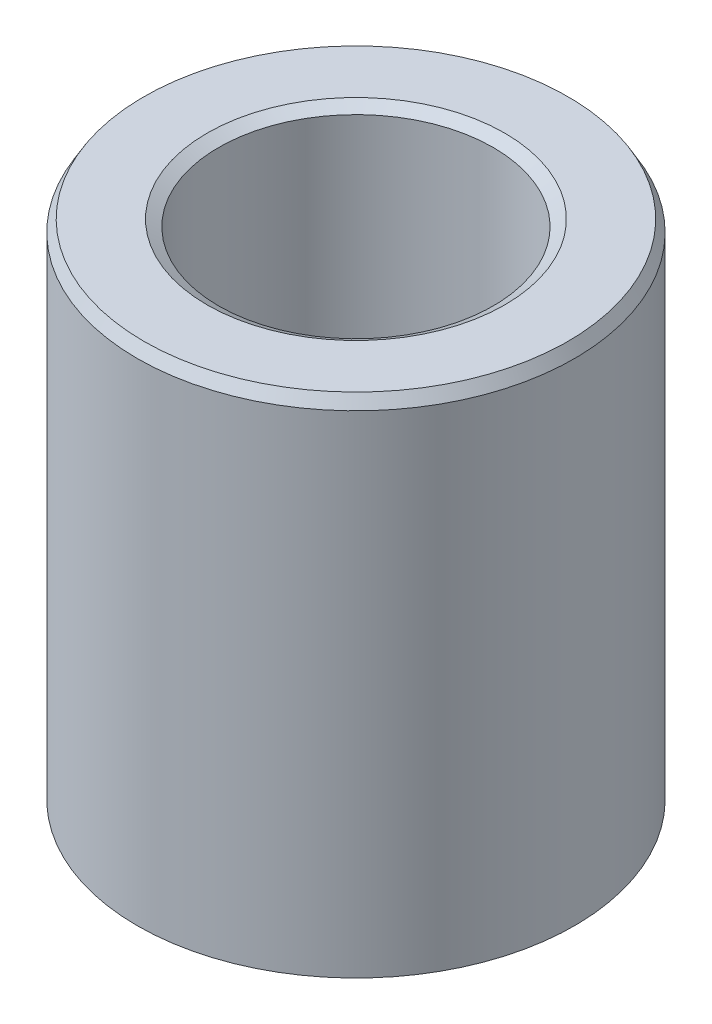
ISO-10303-21;
HEADER;
FILE_DESCRIPTION(('STEP AP214'),'2;1');
FILE_NAME('part.step','',(''),(''),'','','');
FILE_SCHEMA(('AUTOMOTIVE_DESIGN { 1 0 10303 214 1 1 1 1 }'));
ENDSEC;
DATA;
#1=APPLICATION_CONTEXT('core data for automotive mechanical design processes');
#2=APPLICATION_PROTOCOL_DEFINITION('international standard','automotive_design',2000,#1);
#3=PRODUCT_CONTEXT('',#1,'mechanical');
#4=PRODUCT('Part','Part','',(#3));
#5=PRODUCT_RELATED_PRODUCT_CATEGORY('part','',(#4));
#6=PRODUCT_DEFINITION_FORMATION('','',#4);
#7=PRODUCT_DEFINITION_CONTEXT('part definition',#1,'design');
#8=PRODUCT_DEFINITION('design','',#6,#7);
#9=PRODUCT_DEFINITION_SHAPE('','',#8);
#10=(LENGTH_UNIT() NAMED_UNIT(*) SI_UNIT(.MILLI.,.METRE.));
#11=(NAMED_UNIT(*) PLANE_ANGLE_UNIT() SI_UNIT($,.RADIAN.));
#12=(NAMED_UNIT(*) SI_UNIT($,.STERADIAN.) SOLID_ANGLE_UNIT());
#13=UNCERTAINTY_MEASURE_WITH_UNIT(LENGTH_MEASURE(1.E-05),#10,'distance_accuracy_value','');
#14=(GEOMETRIC_REPRESENTATION_CONTEXT(3) GLOBAL_UNCERTAINTY_ASSIGNED_CONTEXT((#13)) GLOBAL_UNIT_ASSIGNED_CONTEXT((#10,
#11,#12)) REPRESENTATION_CONTEXT('',''));
#15=CARTESIAN_POINT('',(0.,0.,0.));
#16=DIRECTION('',(0.,0.,1.));
#17=DIRECTION('',(1.,0.,0.));
#18=AXIS2_PLACEMENT_3D('',#15,#16,#17);
#19=CARTESIAN_POINT('',(0.,133.97743534644,0.));
#20=DIRECTION('',(0.,-1.,0.));
#21=DIRECTION('',(0.,0.,-1.));
#22=AXIS2_PLACEMENT_3D('',#19,#20,#21);
#23=CYLINDRICAL_SURFACE('',#22,57.5);
#24=CARTESIAN_POINT('',(0.,1.75030253935946,0.));
#25=DIRECTION('',(0.,1.,0.));
#26=DIRECTION('',(0.,0.,1.));
#27=AXIS2_PLACEMENT_3D('',#24,#25,#26);
#28=CIRCLE('',#27,57.5);
#29=CARTESIAN_POINT('',(0.,1.75030253935946,57.5));
#30=VERTEX_POINT('',#29);
#31=EDGE_CURVE('E10',#30,#30,#28,.T.);
#32=ORIENTED_EDGE('',*,*,#31,.T.);
#33=EDGE_LOOP('',(#32));
#34=FACE_BOUND('',#33,.T.);
#35=CARTESIAN_POINT('',(0.,130.945822419652,0.));
#36=DIRECTION('',(0.,1.,0.));
#37=DIRECTION('',(0.,0.,1.));
#38=AXIS2_PLACEMENT_3D('',#35,#36,#37);
#39=CIRCLE('',#38,57.5);
#40=CARTESIAN_POINT('',(0.,130.945822419652,57.5));
#41=VERTEX_POINT('',#40);
#42=EDGE_CURVE('E50',#41,#41,#39,.F.);
#43=ORIENTED_EDGE('',*,*,#42,.T.);
#44=EDGE_LOOP('',(#43));
#45=FACE_BOUND('',#44,.T.);
#46=ADVANCED_FACE('F39',(#34,#45),#23,.T.);
#47=CARTESIAN_POINT('',(0.,133.97743534644,0.));
#48=DIRECTION('',(0.,1.,0.));
#49=DIRECTION('',(0.,0.,1.));
#50=AXIS2_PLACEMENT_3D('',#47,#48,#49);
#51=PLANE('',#50);
#52=CARTESIAN_POINT('',(0.,133.97743534644,0.));
#53=DIRECTION('',(0.,1.,0.));
#54=DIRECTION('',(0.,0.,1.));
#55=AXIS2_PLACEMENT_3D('',#52,#53,#54);
#56=CIRCLE('',#55,39.1396806197418);
#57=CARTESIAN_POINT('',(0.,133.97743534644,39.1396806197418));
#58=VERTEX_POINT('',#57);
#59=EDGE_CURVE('E58',#58,#58,#56,.F.);
#60=ORIENTED_EDGE('',*,*,#59,.T.);
#61=EDGE_LOOP('',(#60));
#62=FACE_BOUND('',#61,.T.);
#63=CARTESIAN_POINT('',(0.,133.97743534644,0.));
#64=DIRECTION('',(0.,1.,0.));
#65=DIRECTION('',(0.,0.,1.));
#66=AXIS2_PLACEMENT_3D('',#63,#64,#65);
#67=CIRCLE('',#66,55.7496974606405);
#68=CARTESIAN_POINT('',(0.,133.97743534644,55.7496974606405));
#69=VERTEX_POINT('',#68);
#70=EDGE_CURVE('E61',#69,#69,#67,.T.);
#71=ORIENTED_EDGE('',*,*,#70,.T.);
#72=EDGE_LOOP('',(#71));
#73=FACE_BOUND('',#72,.T.);
#74=ADVANCED_FACE('F88',(#62,#73),#51,.T.);
#75=CARTESIAN_POINT('',(0.,0.,0.));
#76=DIRECTION('',(0.,1.,0.));
#77=DIRECTION('',(0.,0.,1.));
#78=AXIS2_PLACEMENT_3D('',#75,#76,#77);
#79=PLANE('',#78);
#80=CARTESIAN_POINT('',(0.,0.,0.));
#81=DIRECTION('',(0.,1.,0.));
#82=DIRECTION('',(0.,0.,1.));
#83=AXIS2_PLACEMENT_3D('',#80,#81,#82);
#84=CIRCLE('',#83,37.8583702323139);
#85=CARTESIAN_POINT('',(0.,0.,-37.8583702323139));
#86=VERTEX_POINT('',#85);
#87=EDGE_CURVE('E51',#86,#86,#84,.T.);
#88=ORIENTED_EDGE('',*,*,#87,.T.);
#89=EDGE_LOOP('',(#88));
#90=FACE_BOUND('',#89,.T.);
#91=CARTESIAN_POINT('',(0.,0.,0.));
#92=DIRECTION('',(0.,1.,0.));
#93=DIRECTION('',(0.,0.,1.));
#94=AXIS2_PLACEMENT_3D('',#91,#92,#93);
#95=CIRCLE('',#94,54.4683870732125);
#96=CARTESIAN_POINT('',(0.,0.,54.4683870732125));
#97=VERTEX_POINT('',#96);
#98=EDGE_CURVE('E54',#97,#97,#95,.F.);
#99=ORIENTED_EDGE('',*,*,#98,.T.);
#100=EDGE_LOOP('',(#99));
#101=FACE_BOUND('',#100,.T.);
#102=ADVANCED_FACE('F83',(#90,#101),#79,.F.);
#103=CARTESIAN_POINT('',(0.,133.97743534644,0.));
#104=DIRECTION('',(0.,-1.,0.));
#105=DIRECTION('',(0.,0.,-1.));
#106=AXIS2_PLACEMENT_3D('',#103,#104,#105);
#107=CYLINDRICAL_SURFACE('',#106,36.1080676929544);
#108=CARTESIAN_POINT('',(0.,132.22713280708,0.));
#109=DIRECTION('',(0.,1.,0.));
#110=DIRECTION('',(0.,0.,1.));
#111=AXIS2_PLACEMENT_3D('',#108,#109,#110);
#112=CIRCLE('',#111,36.1080676929544);
#113=CARTESIAN_POINT('',(0.,132.22713280708,36.1080676929544));
#114=VERTEX_POINT('',#113);
#115=EDGE_CURVE('E67',#114,#114,#112,.T.);
#116=ORIENTED_EDGE('',*,*,#115,.T.);
#117=EDGE_LOOP('',(#116));
#118=FACE_BOUND('',#117,.T.);
#119=CARTESIAN_POINT('',(0.,3.03161292678752,0.));
#120=DIRECTION('',(0.,1.,0.));
#121=DIRECTION('',(0.,0.,1.));
#122=AXIS2_PLACEMENT_3D('',#119,#120,#121);
#123=CIRCLE('',#122,36.1080676929544);
#124=CARTESIAN_POINT('',(0.,3.03161292678752,-36.1080676929544));
#125=VERTEX_POINT('',#124);
#126=EDGE_CURVE('E69',#125,#125,#123,.F.);
#127=ORIENTED_EDGE('',*,*,#126,.T.);
#128=EDGE_LOOP('',(#127));
#129=FACE_BOUND('',#128,.T.);
#130=ADVANCED_FACE('F71',(#118,#129),#107,.F.);
#131=CARTESIAN_POINT('',(0.,132.22713280708,0.));
#132=DIRECTION('',(0.,1.,0.));
#133=DIRECTION('',(0.,0.,1.));
#134=AXIS2_PLACEMENT_3D('',#131,#132,#133);
#135=CONICAL_SURFACE('',#134,36.1080676929544,1.0471975511966);
#136=ORIENTED_EDGE('',*,*,#59,.F.);
#137=EDGE_LOOP('',(#136));
#138=FACE_BOUND('',#137,.T.);
#139=ORIENTED_EDGE('',*,*,#115,.F.);
#140=EDGE_LOOP('',(#139));
#141=FACE_BOUND('',#140,.T.);
#142=ADVANCED_FACE('F77',(#138,#141),#135,.F.);
#143=CARTESIAN_POINT('',(0.,0.,0.));
#144=DIRECTION('',(0.,-1.,0.));
#145=DIRECTION('',(0.,0.,-1.));
#146=AXIS2_PLACEMENT_3D('',#143,#144,#145);
#147=CONICAL_SURFACE('',#146,37.8583702323139,0.52359877559829);
#148=CARTESIAN_POINT('',(0.,3.03161292678752,-36.1080676929544));
#149=CARTESIAN_POINT('',(0.,3.00003362546682,-36.1263000110727));
#150=CARTESIAN_POINT('',(0.,2.96845432414612,-36.144532329191));
#151=CARTESIAN_POINT('',(0.,2.90529572150471,-36.1809969654277));
#152=CARTESIAN_POINT('',(0.,2.87371642018401,-36.199229283546));
#153=CARTESIAN_POINT('',(0.,2.8105578175426,-36.2356939197827));
#154=CARTESIAN_POINT('',(0.,2.7789785162219,-36.253926237901));
#155=CARTESIAN_POINT('',(0.,2.71581991358049,-36.2903908741377));
#156=CARTESIAN_POINT('',(0.,2.68424061225979,-36.308623192256));
#157=CARTESIAN_POINT('',(0.,2.62108200961838,-36.3450878284926));
#158=CARTESIAN_POINT('',(0.,2.58950270829768,-36.363320146611));
#159=CARTESIAN_POINT('',(0.,2.52634410565627,-36.3997847828476));
#160=CARTESIAN_POINT('',(0.,2.49476480433557,-36.4180171009659));
#161=CARTESIAN_POINT('',(0.,2.43160620169416,-36.4544817372026));
#162=CARTESIAN_POINT('',(0.,2.40002690037346,-36.4727140553209));
#163=CARTESIAN_POINT('',(0.,2.33686829773205,-36.5091786915576));
#164=CARTESIAN_POINT('',(0.,2.30528899641135,-36.5274110096759));
#165=CARTESIAN_POINT('',(0.,2.24213039376994,-36.5638756459126));
#166=CARTESIAN_POINT('',(0.,2.21055109244924,-36.5821079640309));
#167=CARTESIAN_POINT('',(0.,2.14739248980783,-36.6185726002676));
#168=CARTESIAN_POINT('',(0.,2.11581318848713,-36.6368049183859));
#169=CARTESIAN_POINT('',(0.,2.05265458584572,-36.6732695546225));
#170=CARTESIAN_POINT('',(0.,2.02107528452502,-36.6915018727409));
#171=CARTESIAN_POINT('',(0.,1.95791668188361,-36.7279665089775));
#172=CARTESIAN_POINT('',(0.,1.92633738056291,-36.7461988270959));
#173=CARTESIAN_POINT('',(0.,1.8631787779215,-36.7826634633325));
#174=CARTESIAN_POINT('',(0.,1.8315994766008,-36.8008957814508));
#175=CARTESIAN_POINT('',(0.,1.76844087395939,-36.8373604176875));
#176=CARTESIAN_POINT('',(0.,1.73686157263869,-36.8555927358058));
#177=CARTESIAN_POINT('',(0.,1.67370296999728,-36.8920573720425));
#178=CARTESIAN_POINT('',(0.,1.64212366867657,-36.9102896901608));
#179=CARTESIAN_POINT('',(0.,1.57896506603517,-36.9467543263975));
#180=CARTESIAN_POINT('',(0.,1.54738576471447,-36.9649866445158));
#181=CARTESIAN_POINT('',(0.,1.48422716207306,-37.0014512807525));
#182=CARTESIAN_POINT('',(0.,1.45264786075236,-37.0196835988708));
#183=CARTESIAN_POINT('',(0.,1.38948925811095,-37.0561482351074));
#184=CARTESIAN_POINT('',(0.,1.35790995679025,-37.0743805532258));
#185=CARTESIAN_POINT('',(0.,1.29475135414884,-37.1108451894624));
#186=CARTESIAN_POINT('',(0.,1.26317205282813,-37.1290775075807));
#187=CARTESIAN_POINT('',(0.,1.20001345018673,-37.1655421438174));
#188=CARTESIAN_POINT('',(0.,1.16843414886602,-37.1837744619357));
#189=CARTESIAN_POINT('',(0.,1.10527554622462,-37.2202390981724));
#190=CARTESIAN_POINT('',(0.,1.07369624490391,-37.2384714162907));
#191=CARTESIAN_POINT('',(0.,1.01053764226251,-37.2749360525274));
#192=CARTESIAN_POINT('',(0.,0.978958340941805,-37.2931683706457));
#193=CARTESIAN_POINT('',(0.,0.915799738300398,-37.3296330068824));
#194=CARTESIAN_POINT('',(0.,0.884220436979695,-37.3478653250007));
#195=CARTESIAN_POINT('',(0.,0.821061834338288,-37.3843299612373));
#196=CARTESIAN_POINT('',(0.,0.789482533017585,-37.4025622793557));
#197=CARTESIAN_POINT('',(0.,0.726323930376178,-37.4390269155923));
#198=CARTESIAN_POINT('',(0.,0.694744629055474,-37.4572592337106));
#199=CARTESIAN_POINT('',(0.,0.631586026414067,-37.4937238699473));
#200=CARTESIAN_POINT('',(0.,0.600006725093364,-37.5119561880656));
#201=CARTESIAN_POINT('',(0.,0.536848122451957,-37.5484208243023));
#202=CARTESIAN_POINT('',(0.,0.505268821131254,-37.5666531424206));
#203=CARTESIAN_POINT('',(0.,0.442110218489847,-37.6031177786573));
#204=CARTESIAN_POINT('',(0.,0.410530917169144,-37.6213500967756));
#205=CARTESIAN_POINT('',(0.,0.347372314527737,-37.6578147330123));
#206=CARTESIAN_POINT('',(0.,0.315793013207034,-37.6760470511306));
#207=CARTESIAN_POINT('',(0.,0.252634410565627,-37.7125116873672));
#208=CARTESIAN_POINT('',(0.,0.221055109244924,-37.7307440054856));
#209=CARTESIAN_POINT('',(0.,0.157896506603517,-37.7672086417222));
#210=CARTESIAN_POINT('',(0.,0.126317205282814,-37.7854409598405));
#211=CARTESIAN_POINT('',(0.,0.0631586026414068,-37.8219055960772));
#212=CARTESIAN_POINT('',(0.,0.0315793013207033,-37.8401379141955));
#213=CARTESIAN_POINT('',(0.,0.,-37.8583702323139));
#214=B_SPLINE_CURVE_WITH_KNOTS('',3,(#148,#149,#150,#151,#152,#153,#154,#155,#156,#157,#158,
#159,#160,#161,#162,#163,#164,#165,#166,#167,#168,#169,#170,#171,#172,#173,#174,#175,#176,#177,
#178,#179,#180,#181,#182,#183,#184,#185,#186,#187,#188,#189,#190,#191,#192,#193,#194,#195,#196,
#197,#198,#199,#200,#201,#202,#203,#204,#205,#206,#207,#208,#209,#210,#211,#212,#213),
.UNSPECIFIED.,.F.,.F.,(4,2,2,2,2,2,2,2,2,2,2,2,2,2,2,2,2,2,2,2,2,2,2,2,2,2,2,2,2,2,2,2,4),(0.,
0.10939390870997,0.218787817419939,0.328181726129909,0.437575634839879,0.546969543549849,
0.656363452259818,0.765757360969788,0.875151269679758,0.984545178389728,1.0939390870997,
1.20333299580967,1.31272690451964,1.42212081322961,1.53151472193958,1.64090863064955,
1.75030253935952,1.85969644806949,1.96909035677946,2.07848426548943,2.1878781741994,
2.29727208290937,2.40666599161934,2.51605990032931,2.62545380903928,2.73484771774925,
2.84424162645922,2.95363553516919,3.06302944387916,3.17242335258913,3.2818172612991,
3.39121117000907,3.50060507871904),.UNSPECIFIED.);
#215=EDGE_CURVE('BSEAM73',#125,#86,#214,.T.);
#216=ORIENTED_EDGE('',*,*,#126,.F.);
#217=ORIENTED_EDGE('',*,*,#87,.F.);
#218=ORIENTED_EDGE('',*,*,#215,.T.);
#219=ORIENTED_EDGE('',*,*,#215,.F.);
#220=EDGE_LOOP('',(#216,#218,#217,#219));
#221=FACE_BOUND('',#220,.T.);
#222=ADVANCED_FACE('F73',(#221),#147,.F.);
#223=CARTESIAN_POINT('',(0.,1.75030253935946,0.));
#224=DIRECTION('',(0.,1.,0.));
#225=DIRECTION('',(0.,0.,1.));
#226=AXIS2_PLACEMENT_3D('',#223,#224,#225);
#227=CONICAL_SURFACE('',#226,57.5,1.04719755119661);
#228=ORIENTED_EDGE('',*,*,#98,.F.);
#229=EDGE_LOOP('',(#228));
#230=FACE_BOUND('',#229,.T.);
#231=ORIENTED_EDGE('',*,*,#31,.F.);
#232=EDGE_LOOP('',(#231));
#233=FACE_BOUND('',#232,.T.);
#234=ADVANCED_FACE('F76',(#230,#233),#227,.T.);
#235=CARTESIAN_POINT('',(0.,133.97743534644,0.));
#236=DIRECTION('',(0.,-1.,0.));
#237=DIRECTION('',(0.,0.,-1.));
#238=AXIS2_PLACEMENT_3D('',#235,#236,#237);
#239=CONICAL_SURFACE('',#238,55.7496974606405,0.523598775598294);
#240=ORIENTED_EDGE('',*,*,#42,.F.);
#241=EDGE_LOOP('',(#240));
#242=FACE_BOUND('',#241,.T.);
#243=ORIENTED_EDGE('',*,*,#70,.F.);
#244=EDGE_LOOP('',(#243));
#245=FACE_BOUND('',#244,.T.);
#246=ADVANCED_FACE('F45',(#242,#245),#239,.T.);
#247=CLOSED_SHELL('',(#46,#74,#102,#130,#142,#222,#234,#246));
#248=MANIFOLD_SOLID_BREP('B2',#247);
#249=ADVANCED_BREP_SHAPE_REPRESENTATION('',(#18,#248),#14);
#250=SHAPE_DEFINITION_REPRESENTATION(#9,#249);
ENDSEC;
END-ISO-10303-21;
